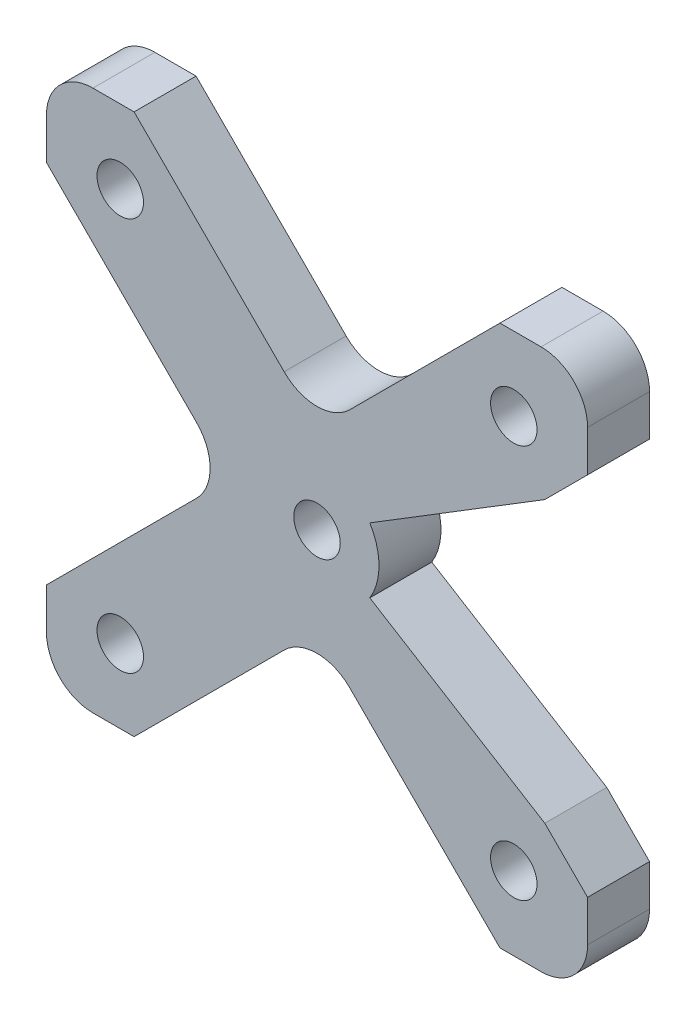
ISO-10303-21;
HEADER;
FILE_DESCRIPTION(('STEP AP214'),'2;1');
FILE_NAME('part.step','',(''),(''),'','','');
FILE_SCHEMA(('AUTOMOTIVE_DESIGN { 1 0 10303 214 1 1 1 1 }'));
ENDSEC;
DATA;
#1=APPLICATION_CONTEXT('core data for automotive mechanical design processes');
#2=APPLICATION_PROTOCOL_DEFINITION('international standard','automotive_design',2000,#1);
#3=PRODUCT_CONTEXT('',#1,'mechanical');
#4=PRODUCT('Part','Part','',(#3));
#5=PRODUCT_RELATED_PRODUCT_CATEGORY('part','',(#4));
#6=PRODUCT_DEFINITION_FORMATION('','',#4);
#7=PRODUCT_DEFINITION_CONTEXT('part definition',#1,'design');
#8=PRODUCT_DEFINITION('design','',#6,#7);
#9=PRODUCT_DEFINITION_SHAPE('','',#8);
#10=(LENGTH_UNIT() NAMED_UNIT(*) SI_UNIT(.MILLI.,.METRE.));
#11=(NAMED_UNIT(*) PLANE_ANGLE_UNIT() SI_UNIT($,.RADIAN.));
#12=(NAMED_UNIT(*) SI_UNIT($,.STERADIAN.) SOLID_ANGLE_UNIT());
#13=UNCERTAINTY_MEASURE_WITH_UNIT(LENGTH_MEASURE(1.E-05),#10,'distance_accuracy_value','');
#14=(GEOMETRIC_REPRESENTATION_CONTEXT(3) GLOBAL_UNCERTAINTY_ASSIGNED_CONTEXT((#13)) GLOBAL_UNIT_ASSIGNED_CONTEXT((#10,
#11,#12)) REPRESENTATION_CONTEXT('',''));
#15=CARTESIAN_POINT('',(0.,0.,0.));
#16=DIRECTION('',(0.,0.,1.));
#17=DIRECTION('',(1.,0.,0.));
#18=AXIS2_PLACEMENT_3D('',#15,#16,#17);
#19=CARTESIAN_POINT('',(0.,0.,4.));
#20=DIRECTION('',(0.,0.,1.));
#21=DIRECTION('',(1.,0.,0.));
#22=AXIS2_PLACEMENT_3D('',#19,#20,#21);
#23=PLANE('',#22);
#24=CARTESIAN_POINT('',(-12.7,-12.7,4.));
#25=DIRECTION('',(0.,0.,1.));
#26=DIRECTION('',(1.,0.,0.));
#27=AXIS2_PLACEMENT_3D('',#24,#25,#26);
#28=CIRCLE('',#27,1.5);
#29=CARTESIAN_POINT('',(-11.2,-12.7,4.));
#30=VERTEX_POINT('',#29);
#31=EDGE_CURVE('E363',#30,#30,#28,.T.);
#32=ORIENTED_EDGE('',*,*,#31,.F.);
#33=EDGE_LOOP('',(#32));
#34=FACE_BOUND('',#33,.T.);
#35=CARTESIAN_POINT('',(-12.7,12.7,4.));
#36=DIRECTION('',(0.,0.,1.));
#37=DIRECTION('',(1.,0.,0.));
#38=AXIS2_PLACEMENT_3D('',#35,#36,#37);
#39=CIRCLE('',#38,1.5);
#40=CARTESIAN_POINT('',(-11.2,12.7,4.));
#41=VERTEX_POINT('',#40);
#42=EDGE_CURVE('E366',#41,#41,#39,.T.);
#43=ORIENTED_EDGE('',*,*,#42,.F.);
#44=EDGE_LOOP('',(#43));
#45=FACE_BOUND('',#44,.T.);
#46=CARTESIAN_POINT('',(12.7,-12.7,4.));
#47=DIRECTION('',(0.,0.,1.));
#48=DIRECTION('',(1.,0.,0.));
#49=AXIS2_PLACEMENT_3D('',#46,#47,#48);
#50=CIRCLE('',#49,1.5);
#51=CARTESIAN_POINT('',(14.2,-12.7,4.));
#52=VERTEX_POINT('',#51);
#53=EDGE_CURVE('E370',#52,#52,#50,.T.);
#54=ORIENTED_EDGE('',*,*,#53,.F.);
#55=EDGE_LOOP('',(#54));
#56=FACE_BOUND('',#55,.T.);
#57=CARTESIAN_POINT('',(12.7,12.7,4.));
#58=DIRECTION('',(0.,0.,1.));
#59=DIRECTION('',(1.,0.,0.));
#60=AXIS2_PLACEMENT_3D('',#57,#58,#59);
#61=CIRCLE('',#60,1.5);
#62=CARTESIAN_POINT('',(14.2,12.7,4.));
#63=VERTEX_POINT('',#62);
#64=EDGE_CURVE('E373',#63,#63,#61,.T.);
#65=ORIENTED_EDGE('',*,*,#64,.F.);
#66=EDGE_LOOP('',(#65));
#67=FACE_BOUND('',#66,.T.);
#68=CARTESIAN_POINT('',(0.,0.,4.));
#69=DIRECTION('',(0.,0.,1.));
#70=DIRECTION('',(1.,0.,0.));
#71=AXIS2_PLACEMENT_3D('',#68,#69,#70);
#72=CIRCLE('',#71,1.5);
#73=CARTESIAN_POINT('',(1.49999999999999,0.,4.));
#74=VERTEX_POINT('',#73);
#75=EDGE_CURVE('E389',#74,#74,#72,.T.);
#76=ORIENTED_EDGE('',*,*,#75,.F.);
#77=EDGE_LOOP('',(#76));
#78=FACE_BOUND('',#77,.T.);
#79=DIRECTION('',(0.707106781186548,-0.707106781186548,0.));
#80=VECTOR('',#79,1.);
#81=CARTESIAN_POINT('',(2.82842712474619,2.82842712474619,4.));
#82=LINE('',#81,#80);
#83=CARTESIAN_POINT('',(14.7,-9.04314575050763,4.));
#84=VERTEX_POINT('',#83);
#85=CARTESIAN_POINT('',(17.4625,-11.8056457505076,4.));
#86=VERTEX_POINT('',#85);
#87=EDGE_CURVE('E332',#84,#86,#82,.T.);
#88=ORIENTED_EDGE('',*,*,#87,.F.);
#89=DIRECTION('',(-0.85173610323474,0.523971001532052,0.));
#90=VECTOR('',#89,1.);
#91=CARTESIAN_POINT('',(0.,0.,4.));
#92=LINE('',#91,#90);
#93=CARTESIAN_POINT('',(3.40694441293896,-2.09588400612821,4.));
#94=VERTEX_POINT('',#93);
#95=EDGE_CURVE('E123',#84,#94,#92,.T.);
#96=ORIENTED_EDGE('',*,*,#95,.T.);
#97=CARTESIAN_POINT('',(0.,0.,4.));
#98=DIRECTION('',(0.,0.,1.));
#99=DIRECTION('',(1.,0.,0.));
#100=AXIS2_PLACEMENT_3D('',#97,#98,#99);
#101=CIRCLE('',#100,4.);
#102=CARTESIAN_POINT('',(3.40694441293896,2.09588400612821,4.));
#103=VERTEX_POINT('',#102);
#104=EDGE_CURVE('E316',#94,#103,#101,.T.);
#105=ORIENTED_EDGE('',*,*,#104,.T.);
#106=DIRECTION('',(0.851736103234739,0.523971001532052,0.));
#107=VECTOR('',#106,1.);
#108=CARTESIAN_POINT('',(0.,0.,4.));
#109=LINE('',#108,#107);
#110=CARTESIAN_POINT('',(14.7,9.04314575050764,4.));
#111=VERTEX_POINT('',#110);
#112=EDGE_CURVE('E289',#103,#111,#109,.T.);
#113=ORIENTED_EDGE('',*,*,#112,.T.);
#114=DIRECTION('',(0.707106781186548,0.707106781186548,0.));
#115=VECTOR('',#114,1.);
#116=CARTESIAN_POINT('',(2.82842712474618,-2.82842712474618,4.));
#117=LINE('',#116,#115);
#118=CARTESIAN_POINT('',(17.4625,11.8056457505076,4.));
#119=VERTEX_POINT('',#118);
#120=EDGE_CURVE('E328',#111,#119,#117,.T.);
#121=ORIENTED_EDGE('',*,*,#120,.T.);
#122=DIRECTION('',(0.,1.,0.));
#123=VECTOR('',#122,1.);
#124=CARTESIAN_POINT('',(17.4625,0.,4.));
#125=LINE('',#124,#123);
#126=CARTESIAN_POINT('',(17.4625,14.4625,4.));
#127=VERTEX_POINT('',#126);
#128=EDGE_CURVE('E382',#119,#127,#125,.T.);
#129=ORIENTED_EDGE('',*,*,#128,.T.);
#130=CARTESIAN_POINT('',(14.4625,14.4625,4.));
#131=DIRECTION('',(0.,0.,1.));
#132=DIRECTION('',(1.,0.,0.));
#133=AXIS2_PLACEMENT_3D('',#130,#131,#132);
#134=CIRCLE('',#133,3.);
#135=CARTESIAN_POINT('',(14.4625,17.4625,4.));
#136=VERTEX_POINT('',#135);
#137=EDGE_CURVE('E464',#127,#136,#134,.T.);
#138=ORIENTED_EDGE('',*,*,#137,.T.);
#139=DIRECTION('',(-1.,0.,0.));
#140=VECTOR('',#139,1.);
#141=CARTESIAN_POINT('',(0.,17.4625,4.));
#142=LINE('',#141,#140);
#143=CARTESIAN_POINT('',(11.8056457505076,17.4625,4.));
#144=VERTEX_POINT('',#143);
#145=EDGE_CURVE('E386',#136,#144,#142,.T.);
#146=ORIENTED_EDGE('',*,*,#145,.T.);
#147=DIRECTION('',(0.707106781186548,0.707106781186548,0.));
#148=VECTOR('',#147,1.);
#149=CARTESIAN_POINT('',(-2.82842712474619,2.82842712474619,4.));
#150=LINE('',#149,#148);
#151=CARTESIAN_POINT('',(2.12132034355964,7.77817459305203,4.));
#152=VERTEX_POINT('',#151);
#153=EDGE_CURVE('E343',#152,#144,#150,.T.);
#154=ORIENTED_EDGE('',*,*,#153,.F.);
#155=CARTESIAN_POINT('',(0.,9.89949493661167,4.));
#156=DIRECTION('',(0.,0.,1.));
#157=DIRECTION('',(1.,0.,0.));
#158=AXIS2_PLACEMENT_3D('',#155,#156,#157);
#159=CIRCLE('',#158,3.);
#160=CARTESIAN_POINT('',(-2.12132034355965,7.77817459305203,4.));
#161=VERTEX_POINT('',#160);
#162=EDGE_CURVE('E116',#152,#161,#159,.F.);
#163=ORIENTED_EDGE('',*,*,#162,.T.);
#164=DIRECTION('',(0.707106781186548,-0.707106781186548,0.));
#165=VECTOR('',#164,1.);
#166=CARTESIAN_POINT('',(2.82842712474619,2.82842712474619,4.));
#167=LINE('',#166,#165);
#168=CARTESIAN_POINT('',(-11.8056457505076,17.4625,4.));
#169=VERTEX_POINT('',#168);
#170=EDGE_CURVE('E338',#169,#161,#167,.T.);
#171=ORIENTED_EDGE('',*,*,#170,.F.);
#172=CARTESIAN_POINT('',(-14.4625,17.4625,4.));
#173=VERTEX_POINT('',#172);
#174=EDGE_CURVE('E385',#169,#173,#142,.T.);
#175=ORIENTED_EDGE('',*,*,#174,.T.);
#176=CARTESIAN_POINT('',(-14.4625,14.4625,4.));
#177=DIRECTION('',(0.,0.,1.));
#178=DIRECTION('',(1.,0.,0.));
#179=AXIS2_PLACEMENT_3D('',#176,#177,#178);
#180=CIRCLE('',#179,3.);
#181=CARTESIAN_POINT('',(-17.4625,14.4625,4.));
#182=VERTEX_POINT('',#181);
#183=EDGE_CURVE('E462',#173,#182,#180,.T.);
#184=ORIENTED_EDGE('',*,*,#183,.T.);
#185=DIRECTION('',(0.,1.,0.));
#186=VECTOR('',#185,1.);
#187=CARTESIAN_POINT('',(-17.4625,0.,4.));
#188=LINE('',#187,#186);
#189=CARTESIAN_POINT('',(-17.4625,11.8056457505076,4.));
#190=VERTEX_POINT('',#189);
#191=EDGE_CURVE('E376',#190,#182,#188,.T.);
#192=ORIENTED_EDGE('',*,*,#191,.F.);
#193=DIRECTION('',(0.707106781186548,-0.707106781186548,0.));
#194=VECTOR('',#193,1.);
#195=CARTESIAN_POINT('',(-2.82842712474619,-2.82842712474619,4.));
#196=LINE('',#195,#194);
#197=CARTESIAN_POINT('',(-7.77817459305203,2.12132034355965,4.));
#198=VERTEX_POINT('',#197);
#199=EDGE_CURVE('E353',#190,#198,#196,.T.);
#200=ORIENTED_EDGE('',*,*,#199,.T.);
#201=CARTESIAN_POINT('',(-9.89949493661167,0.,4.));
#202=DIRECTION('',(0.,0.,1.));
#203=DIRECTION('',(1.,0.,0.));
#204=AXIS2_PLACEMENT_3D('',#201,#202,#203);
#205=CIRCLE('',#204,3.);
#206=CARTESIAN_POINT('',(-7.77817459305203,-2.12132034355964,4.));
#207=VERTEX_POINT('',#206);
#208=EDGE_CURVE('E489',#198,#207,#205,.F.);
#209=ORIENTED_EDGE('',*,*,#208,.T.);
#210=DIRECTION('',(0.707106781186548,0.707106781186548,0.));
#211=VECTOR('',#210,1.);
#212=CARTESIAN_POINT('',(-2.82842712474619,2.82842712474619,4.));
#213=LINE('',#212,#211);
#214=CARTESIAN_POINT('',(-17.4625,-11.8056457505076,4.));
#215=VERTEX_POINT('',#214);
#216=EDGE_CURVE('E348',#215,#207,#213,.T.);
#217=ORIENTED_EDGE('',*,*,#216,.F.);
#218=CARTESIAN_POINT('',(-17.4625,-14.4625,4.));
#219=VERTEX_POINT('',#218);
#220=EDGE_CURVE('E377',#219,#215,#188,.T.);
#221=ORIENTED_EDGE('',*,*,#220,.F.);
#222=CARTESIAN_POINT('',(-14.4625,-14.4625,4.));
#223=DIRECTION('',(0.,0.,1.));
#224=DIRECTION('',(1.,0.,0.));
#225=AXIS2_PLACEMENT_3D('',#222,#223,#224);
#226=CIRCLE('',#225,3.);
#227=CARTESIAN_POINT('',(-14.4625,-17.4625,4.));
#228=VERTEX_POINT('',#227);
#229=EDGE_CURVE('E467',#219,#228,#226,.T.);
#230=ORIENTED_EDGE('',*,*,#229,.T.);
#231=DIRECTION('',(-1.,0.,0.));
#232=VECTOR('',#231,1.);
#233=CARTESIAN_POINT('',(0.,-17.4625,4.));
#234=LINE('',#233,#232);
#235=CARTESIAN_POINT('',(-11.8056457505076,-17.4625,4.));
#236=VERTEX_POINT('',#235);
#237=EDGE_CURVE('E379',#236,#228,#234,.T.);
#238=ORIENTED_EDGE('',*,*,#237,.F.);
#239=DIRECTION('',(0.707106781186548,0.707106781186548,0.));
#240=VECTOR('',#239,1.);
#241=CARTESIAN_POINT('',(2.82842712474618,-2.82842712474618,4.));
#242=LINE('',#241,#240);
#243=CARTESIAN_POINT('',(-2.12132034355965,-7.77817459305202,4.));
#244=VERTEX_POINT('',#243);
#245=EDGE_CURVE('E318',#236,#244,#242,.T.);
#246=ORIENTED_EDGE('',*,*,#245,.T.);
#247=CARTESIAN_POINT('',(0.,-9.89949493661166,4.));
#248=DIRECTION('',(0.,0.,1.));
#249=DIRECTION('',(1.,0.,0.));
#250=AXIS2_PLACEMENT_3D('',#247,#248,#249);
#251=CIRCLE('',#250,3.);
#252=CARTESIAN_POINT('',(2.12132034355964,-7.77817459305202,4.));
#253=VERTEX_POINT('',#252);
#254=EDGE_CURVE('E493',#244,#253,#251,.F.);
#255=ORIENTED_EDGE('',*,*,#254,.T.);
#256=DIRECTION('',(0.707106781186548,-0.707106781186548,0.));
#257=VECTOR('',#256,1.);
#258=CARTESIAN_POINT('',(-2.82842712474619,-2.82842712474619,4.));
#259=LINE('',#258,#257);
#260=CARTESIAN_POINT('',(11.8056457505076,-17.4625,4.));
#261=VERTEX_POINT('',#260);
#262=EDGE_CURVE('E321',#253,#261,#259,.T.);
#263=ORIENTED_EDGE('',*,*,#262,.T.);
#264=CARTESIAN_POINT('',(14.4625,-17.4625,4.));
#265=VERTEX_POINT('',#264);
#266=EDGE_CURVE('E380',#265,#261,#234,.T.);
#267=ORIENTED_EDGE('',*,*,#266,.F.);
#268=CARTESIAN_POINT('',(14.4625,-14.4625,4.));
#269=DIRECTION('',(0.,0.,1.));
#270=DIRECTION('',(1.,0.,0.));
#271=AXIS2_PLACEMENT_3D('',#268,#269,#270);
#272=CIRCLE('',#271,3.);
#273=CARTESIAN_POINT('',(17.4625,-14.4625,4.));
#274=VERTEX_POINT('',#273);
#275=EDGE_CURVE('E131',#265,#274,#272,.T.);
#276=ORIENTED_EDGE('',*,*,#275,.T.);
#277=EDGE_CURVE('E383',#274,#86,#125,.T.);
#278=ORIENTED_EDGE('',*,*,#277,.T.);
#279=EDGE_LOOP('',(#88,#96,#105,#113,#121,#129,#138,#146,#154,#163,#171,#175,#184,#192,#200,
#209,#217,#221,#230,#238,#246,#255,#263,#267,#276,#278));
#280=FACE_BOUND('',#279,.T.);
#281=ADVANCED_FACE('F108',(#34,#45,#56,#67,#78,#280),#23,.T.);
#282=CARTESIAN_POINT('',(0.,0.,0.));
#283=DIRECTION('',(0.,0.,1.));
#284=DIRECTION('',(1.,0.,0.));
#285=AXIS2_PLACEMENT_3D('',#282,#283,#284);
#286=PLANE('',#285);
#287=CARTESIAN_POINT('',(-12.7,-12.7,0.));
#288=DIRECTION('',(0.,0.,1.));
#289=DIRECTION('',(1.,0.,0.));
#290=AXIS2_PLACEMENT_3D('',#287,#288,#289);
#291=CIRCLE('',#290,1.5);
#292=CARTESIAN_POINT('',(-11.2,-12.7,0.));
#293=VERTEX_POINT('',#292);
#294=EDGE_CURVE('E360',#293,#293,#291,.T.);
#295=ORIENTED_EDGE('',*,*,#294,.T.);
#296=EDGE_LOOP('',(#295));
#297=FACE_BOUND('',#296,.T.);
#298=CARTESIAN_POINT('',(-12.7,12.7,0.));
#299=DIRECTION('',(0.,0.,1.));
#300=DIRECTION('',(1.,0.,0.));
#301=AXIS2_PLACEMENT_3D('',#298,#299,#300);
#302=CIRCLE('',#301,1.5);
#303=CARTESIAN_POINT('',(-11.2,12.7,0.));
#304=VERTEX_POINT('',#303);
#305=EDGE_CURVE('E395',#304,#304,#302,.T.);
#306=ORIENTED_EDGE('',*,*,#305,.T.);
#307=EDGE_LOOP('',(#306));
#308=FACE_BOUND('',#307,.T.);
#309=CARTESIAN_POINT('',(12.7,-12.7,0.));
#310=DIRECTION('',(0.,0.,1.));
#311=DIRECTION('',(1.,0.,0.));
#312=AXIS2_PLACEMENT_3D('',#309,#310,#311);
#313=CIRCLE('',#312,1.5);
#314=CARTESIAN_POINT('',(14.2,-12.7,0.));
#315=VERTEX_POINT('',#314);
#316=EDGE_CURVE('E398',#315,#315,#313,.T.);
#317=ORIENTED_EDGE('',*,*,#316,.T.);
#318=EDGE_LOOP('',(#317));
#319=FACE_BOUND('',#318,.T.);
#320=CARTESIAN_POINT('',(12.7,12.7,0.));
#321=DIRECTION('',(0.,0.,1.));
#322=DIRECTION('',(1.,0.,0.));
#323=AXIS2_PLACEMENT_3D('',#320,#321,#322);
#324=CIRCLE('',#323,1.5);
#325=CARTESIAN_POINT('',(14.2,12.7,0.));
#326=VERTEX_POINT('',#325);
#327=EDGE_CURVE('E401',#326,#326,#324,.T.);
#328=ORIENTED_EDGE('',*,*,#327,.T.);
#329=EDGE_LOOP('',(#328));
#330=FACE_BOUND('',#329,.T.);
#331=CARTESIAN_POINT('',(0.,0.,0.));
#332=DIRECTION('',(0.,0.,1.));
#333=DIRECTION('',(1.,0.,0.));
#334=AXIS2_PLACEMENT_3D('',#331,#332,#333);
#335=CIRCLE('',#334,1.5);
#336=CARTESIAN_POINT('',(1.49999999999999,0.,0.));
#337=VERTEX_POINT('',#336);
#338=EDGE_CURVE('E367',#337,#337,#335,.T.);
#339=ORIENTED_EDGE('',*,*,#338,.T.);
#340=EDGE_LOOP('',(#339));
#341=FACE_BOUND('',#340,.T.);
#342=DIRECTION('',(0.85173610323474,-0.523971001532052,0.));
#343=VECTOR('',#342,1.);
#344=CARTESIAN_POINT('',(0.,0.,0.));
#345=LINE('',#344,#343);
#346=CARTESIAN_POINT('',(3.40694441293896,-2.09588400612821,0.));
#347=VERTEX_POINT('',#346);
#348=CARTESIAN_POINT('',(14.7,-9.04314575050762,0.));
#349=VERTEX_POINT('',#348);
#350=EDGE_CURVE('E293',#347,#349,#345,.T.);
#351=ORIENTED_EDGE('',*,*,#350,.T.);
#352=DIRECTION('',(0.707106781186548,-0.707106781186548,0.));
#353=VECTOR('',#352,1.);
#354=CARTESIAN_POINT('',(2.82842712474619,2.82842712474619,0.));
#355=LINE('',#354,#353);
#356=CARTESIAN_POINT('',(17.4625,-11.8056457505076,0.));
#357=VERTEX_POINT('',#356);
#358=EDGE_CURVE('E436',#349,#357,#355,.T.);
#359=ORIENTED_EDGE('',*,*,#358,.T.);
#360=DIRECTION('',(0.,1.,0.));
#361=VECTOR('',#360,1.);
#362=CARTESIAN_POINT('',(17.4625,0.,0.));
#363=LINE('',#362,#361);
#364=CARTESIAN_POINT('',(17.4625,-14.4625,0.));
#365=VERTEX_POINT('',#364);
#366=EDGE_CURVE('E411',#365,#357,#363,.T.);
#367=ORIENTED_EDGE('',*,*,#366,.F.);
#368=CARTESIAN_POINT('',(14.4625,-14.4625,0.));
#369=DIRECTION('',(0.,0.,1.));
#370=DIRECTION('',(1.,0.,0.));
#371=AXIS2_PLACEMENT_3D('',#368,#369,#370);
#372=CIRCLE('',#371,3.);
#373=CARTESIAN_POINT('',(14.4625,-17.4625,0.));
#374=VERTEX_POINT('',#373);
#375=EDGE_CURVE('E456',#365,#374,#372,.F.);
#376=ORIENTED_EDGE('',*,*,#375,.T.);
#377=DIRECTION('',(-1.,0.,0.));
#378=VECTOR('',#377,1.);
#379=CARTESIAN_POINT('',(0.,-17.4625,0.));
#380=LINE('',#379,#378);
#381=CARTESIAN_POINT('',(11.8056457505076,-17.4625,0.));
#382=VERTEX_POINT('',#381);
#383=EDGE_CURVE('E408',#374,#382,#380,.T.);
#384=ORIENTED_EDGE('',*,*,#383,.T.);
#385=DIRECTION('',(0.707106781186548,-0.707106781186548,0.));
#386=VECTOR('',#385,1.);
#387=CARTESIAN_POINT('',(-2.82842712474619,-2.82842712474619,0.));
#388=LINE('',#387,#386);
#389=CARTESIAN_POINT('',(2.12132034355964,-7.77817459305202,0.));
#390=VERTEX_POINT('',#389);
#391=EDGE_CURVE('E424',#390,#382,#388,.T.);
#392=ORIENTED_EDGE('',*,*,#391,.F.);
#393=CARTESIAN_POINT('',(0.,-9.89949493661166,0.));
#394=DIRECTION('',(0.,0.,1.));
#395=DIRECTION('',(1.,0.,0.));
#396=AXIS2_PLACEMENT_3D('',#393,#394,#395);
#397=CIRCLE('',#396,3.);
#398=CARTESIAN_POINT('',(-2.12132034355965,-7.77817459305202,0.));
#399=VERTEX_POINT('',#398);
#400=EDGE_CURVE('E495',#390,#399,#397,.T.);
#401=ORIENTED_EDGE('',*,*,#400,.T.);
#402=DIRECTION('',(0.707106781186548,0.707106781186548,0.));
#403=VECTOR('',#402,1.);
#404=CARTESIAN_POINT('',(2.82842712474618,-2.82842712474618,0.));
#405=LINE('',#404,#403);
#406=CARTESIAN_POINT('',(-11.8056457505076,-17.4625,0.));
#407=VERTEX_POINT('',#406);
#408=EDGE_CURVE('E427',#407,#399,#405,.T.);
#409=ORIENTED_EDGE('',*,*,#408,.F.);
#410=CARTESIAN_POINT('',(-14.4625,-17.4625,0.));
#411=VERTEX_POINT('',#410);
#412=EDGE_CURVE('E407',#407,#411,#380,.T.);
#413=ORIENTED_EDGE('',*,*,#412,.T.);
#414=CARTESIAN_POINT('',(-14.4625,-14.4625,0.));
#415=DIRECTION('',(0.,0.,1.));
#416=DIRECTION('',(1.,0.,0.));
#417=AXIS2_PLACEMENT_3D('',#414,#415,#416);
#418=CIRCLE('',#417,3.);
#419=CARTESIAN_POINT('',(-17.4625,-14.4625,0.));
#420=VERTEX_POINT('',#419);
#421=EDGE_CURVE('E458',#411,#420,#418,.F.);
#422=ORIENTED_EDGE('',*,*,#421,.T.);
#423=DIRECTION('',(0.,1.,0.));
#424=VECTOR('',#423,1.);
#425=CARTESIAN_POINT('',(-17.4625,0.,0.));
#426=LINE('',#425,#424);
#427=CARTESIAN_POINT('',(-17.4625,-11.8056457505076,0.));
#428=VERTEX_POINT('',#427);
#429=EDGE_CURVE('E405',#420,#428,#426,.T.);
#430=ORIENTED_EDGE('',*,*,#429,.T.);
#431=DIRECTION('',(0.707106781186548,0.707106781186548,0.));
#432=VECTOR('',#431,1.);
#433=CARTESIAN_POINT('',(-2.82842712474619,2.82842712474619,0.));
#434=LINE('',#433,#432);
#435=CARTESIAN_POINT('',(-7.77817459305203,-2.12132034355964,0.));
#436=VERTEX_POINT('',#435);
#437=EDGE_CURVE('E392',#428,#436,#434,.T.);
#438=ORIENTED_EDGE('',*,*,#437,.T.);
#439=CARTESIAN_POINT('',(-9.89949493661167,0.,0.));
#440=DIRECTION('',(0.,0.,1.));
#441=DIRECTION('',(1.,0.,0.));
#442=AXIS2_PLACEMENT_3D('',#439,#440,#441);
#443=CIRCLE('',#442,3.);
#444=CARTESIAN_POINT('',(-7.77817459305203,2.12132034355965,0.));
#445=VERTEX_POINT('',#444);
#446=EDGE_CURVE('E491',#436,#445,#443,.T.);
#447=ORIENTED_EDGE('',*,*,#446,.T.);
#448=DIRECTION('',(0.707106781186548,-0.707106781186548,0.));
#449=VECTOR('',#448,1.);
#450=CARTESIAN_POINT('',(-2.82842712474619,-2.82842712474619,0.));
#451=LINE('',#450,#449);
#452=CARTESIAN_POINT('',(-17.4625,11.8056457505076,0.));
#453=VERTEX_POINT('',#452);
#454=EDGE_CURVE('E421',#453,#445,#451,.T.);
#455=ORIENTED_EDGE('',*,*,#454,.F.);
#456=CARTESIAN_POINT('',(-17.4625,14.4625,0.));
#457=VERTEX_POINT('',#456);
#458=EDGE_CURVE('E404',#453,#457,#426,.T.);
#459=ORIENTED_EDGE('',*,*,#458,.T.);
#460=CARTESIAN_POINT('',(-14.4625,14.4625,0.));
#461=DIRECTION('',(0.,0.,1.));
#462=DIRECTION('',(1.,0.,0.));
#463=AXIS2_PLACEMENT_3D('',#460,#461,#462);
#464=CIRCLE('',#463,3.);
#465=CARTESIAN_POINT('',(-14.4625,17.4625,0.));
#466=VERTEX_POINT('',#465);
#467=EDGE_CURVE('E452',#457,#466,#464,.F.);
#468=ORIENTED_EDGE('',*,*,#467,.T.);
#469=DIRECTION('',(-1.,0.,0.));
#470=VECTOR('',#469,1.);
#471=CARTESIAN_POINT('',(0.,17.4625,0.));
#472=LINE('',#471,#470);
#473=CARTESIAN_POINT('',(-11.8056457505076,17.4625,0.));
#474=VERTEX_POINT('',#473);
#475=EDGE_CURVE('E414',#474,#466,#472,.T.);
#476=ORIENTED_EDGE('',*,*,#475,.F.);
#477=DIRECTION('',(0.707106781186548,-0.707106781186548,0.));
#478=VECTOR('',#477,1.);
#479=CARTESIAN_POINT('',(2.82842712474619,2.82842712474619,0.));
#480=LINE('',#479,#478);
#481=CARTESIAN_POINT('',(-2.12132034355965,7.77817459305203,0.));
#482=VERTEX_POINT('',#481);
#483=EDGE_CURVE('E433',#474,#482,#480,.T.);
#484=ORIENTED_EDGE('',*,*,#483,.T.);
#485=CARTESIAN_POINT('',(0.,9.89949493661167,0.));
#486=DIRECTION('',(0.,0.,1.));
#487=DIRECTION('',(1.,0.,0.));
#488=AXIS2_PLACEMENT_3D('',#485,#486,#487);
#489=CIRCLE('',#488,3.);
#490=CARTESIAN_POINT('',(2.12132034355964,7.77817459305203,0.));
#491=VERTEX_POINT('',#490);
#492=EDGE_CURVE('E12',#482,#491,#489,.T.);
#493=ORIENTED_EDGE('',*,*,#492,.T.);
#494=DIRECTION('',(0.707106781186548,0.707106781186548,0.));
#495=VECTOR('',#494,1.);
#496=CARTESIAN_POINT('',(-2.82842712474619,2.82842712474619,0.));
#497=LINE('',#496,#495);
#498=CARTESIAN_POINT('',(11.8056457505076,17.4625,0.));
#499=VERTEX_POINT('',#498);
#500=EDGE_CURVE('E430',#491,#499,#497,.T.);
#501=ORIENTED_EDGE('',*,*,#500,.T.);
#502=CARTESIAN_POINT('',(14.4625,17.4625,0.));
#503=VERTEX_POINT('',#502);
#504=EDGE_CURVE('E415',#503,#499,#472,.T.);
#505=ORIENTED_EDGE('',*,*,#504,.F.);
#506=CARTESIAN_POINT('',(14.4625,14.4625,0.));
#507=DIRECTION('',(0.,0.,1.));
#508=DIRECTION('',(1.,0.,0.));
#509=AXIS2_PLACEMENT_3D('',#506,#507,#508);
#510=CIRCLE('',#509,3.);
#511=CARTESIAN_POINT('',(17.4625,14.4625,0.));
#512=VERTEX_POINT('',#511);
#513=EDGE_CURVE('E454',#503,#512,#510,.F.);
#514=ORIENTED_EDGE('',*,*,#513,.T.);
#515=CARTESIAN_POINT('',(17.4625,11.8056457505076,0.));
#516=VERTEX_POINT('',#515);
#517=EDGE_CURVE('E410',#516,#512,#363,.T.);
#518=ORIENTED_EDGE('',*,*,#517,.F.);
#519=DIRECTION('',(0.707106781186548,0.707106781186548,0.));
#520=VECTOR('',#519,1.);
#521=CARTESIAN_POINT('',(2.82842712474618,-2.82842712474618,0.));
#522=LINE('',#521,#520);
#523=CARTESIAN_POINT('',(14.7,9.04314575050764,0.));
#524=VERTEX_POINT('',#523);
#525=EDGE_CURVE('E306',#524,#516,#522,.T.);
#526=ORIENTED_EDGE('',*,*,#525,.F.);
#527=DIRECTION('',(-0.851736103234739,-0.523971001532052,0.));
#528=VECTOR('',#527,1.);
#529=CARTESIAN_POINT('',(0.,0.,0.));
#530=LINE('',#529,#528);
#531=CARTESIAN_POINT('',(3.40694441293896,2.09588400612821,0.));
#532=VERTEX_POINT('',#531);
#533=EDGE_CURVE('E286',#524,#532,#530,.T.);
#534=ORIENTED_EDGE('',*,*,#533,.T.);
#535=CARTESIAN_POINT('',(0.,0.,0.));
#536=DIRECTION('',(0.,0.,-1.));
#537=DIRECTION('',(-1.,0.,0.));
#538=AXIS2_PLACEMENT_3D('',#535,#536,#537);
#539=CIRCLE('',#538,4.);
#540=EDGE_CURVE('E296',#532,#347,#539,.T.);
#541=ORIENTED_EDGE('',*,*,#540,.T.);
#542=EDGE_LOOP('',(#351,#359,#367,#376,#384,#392,#401,#409,#413,#422,#430,#438,#447,#455,#459,
#468,#476,#484,#493,#501,#505,#514,#518,#526,#534,#541));
#543=FACE_BOUND('',#542,.T.);
#544=ADVANCED_FACE('F304',(#297,#308,#319,#330,#341,#543),#286,.F.);
#545=CARTESIAN_POINT('',(2.82842712474618,-2.82842712474618,-1.08));
#546=DIRECTION('',(0.707106781186548,-0.707106781186548,0.));
#547=DIRECTION('',(0.707106781186548,0.707106781186548,0.));
#548=AXIS2_PLACEMENT_3D('',#545,#546,#547);
#549=PLANE('',#548);
#550=ORIENTED_EDGE('',*,*,#120,.F.);
#551=DIRECTION('',(0.,0.,-1.));
#552=VECTOR('',#551,1.);
#553=CARTESIAN_POINT('',(14.7,9.04314575050764,5.08));
#554=LINE('',#553,#552);
#555=EDGE_CURVE('E292',#111,#524,#554,.T.);
#556=ORIENTED_EDGE('',*,*,#555,.T.);
#557=ORIENTED_EDGE('',*,*,#525,.T.);
#558=DIRECTION('',(0.,0.,1.));
#559=VECTOR('',#558,1.);
#560=CARTESIAN_POINT('',(17.4625,11.8056457505076,-1.08));
#561=LINE('',#560,#559);
#562=EDGE_CURVE('E335',#516,#119,#561,.T.);
#563=ORIENTED_EDGE('',*,*,#562,.T.);
#564=EDGE_LOOP('',(#550,#556,#557,#563));
#565=FACE_BOUND('',#564,.T.);
#566=ADVANCED_FACE('F531',(#565),#549,.T.);
#567=CARTESIAN_POINT('',(2.82842712474619,2.82842712474619,-1.08));
#568=DIRECTION('',(-0.707106781186548,-0.707106781186548,0.));
#569=DIRECTION('',(0.707106781186548,-0.707106781186548,0.));
#570=AXIS2_PLACEMENT_3D('',#567,#568,#569);
#571=PLANE('',#570);
#572=DIRECTION('',(0.,0.,-1.));
#573=VECTOR('',#572,1.);
#574=CARTESIAN_POINT('',(14.7,-9.04314575050762,5.08));
#575=LINE('',#574,#573);
#576=EDGE_CURVE('E311',#84,#349,#575,.T.);
#577=ORIENTED_EDGE('',*,*,#576,.F.);
#578=ORIENTED_EDGE('',*,*,#87,.T.);
#579=DIRECTION('',(0.,0.,1.));
#580=VECTOR('',#579,1.);
#581=CARTESIAN_POINT('',(17.4625,-11.8056457505076,-1.08));
#582=LINE('',#581,#580);
#583=EDGE_CURVE('E334',#357,#86,#582,.T.);
#584=ORIENTED_EDGE('',*,*,#583,.F.);
#585=ORIENTED_EDGE('',*,*,#358,.F.);
#586=EDGE_LOOP('',(#577,#578,#584,#585));
#587=FACE_BOUND('',#586,.T.);
#588=ADVANCED_FACE('F533',(#587),#571,.F.);
#589=CARTESIAN_POINT('',(-17.4625,0.,4.));
#590=DIRECTION('',(-1.,0.,0.));
#591=DIRECTION('',(0.,0.,1.));
#592=AXIS2_PLACEMENT_3D('',#589,#590,#591);
#593=PLANE('',#592);
#594=ORIENTED_EDGE('',*,*,#191,.T.);
#595=DIRECTION('',(0.,0.,-1.));
#596=VECTOR('',#595,1.);
#597=CARTESIAN_POINT('',(-17.4625,14.4625,0.));
#598=LINE('',#597,#596);
#599=EDGE_CURVE('E484',#182,#457,#598,.T.);
#600=ORIENTED_EDGE('',*,*,#599,.T.);
#601=ORIENTED_EDGE('',*,*,#458,.F.);
#602=DIRECTION('',(0.,0.,1.));
#603=VECTOR('',#602,1.);
#604=CARTESIAN_POINT('',(-17.4625,11.8056457505076,-1.08));
#605=LINE('',#604,#603);
#606=EDGE_CURVE('E357',#453,#190,#605,.T.);
#607=ORIENTED_EDGE('',*,*,#606,.T.);
#608=EDGE_LOOP('',(#594,#600,#601,#607));
#609=FACE_BOUND('',#608,.T.);
#610=ADVANCED_FACE('F539',(#609),#593,.T.);
#611=CARTESIAN_POINT('',(0.,-17.4625,4.));
#612=DIRECTION('',(0.,-1.,0.));
#613=DIRECTION('',(1.,0.,0.));
#614=AXIS2_PLACEMENT_3D('',#611,#612,#613);
#615=PLANE('',#614);
#616=ORIENTED_EDGE('',*,*,#237,.T.);
#617=DIRECTION('',(0.,0.,-1.));
#618=VECTOR('',#617,1.);
#619=CARTESIAN_POINT('',(-14.4625,-17.4625,4.));
#620=LINE('',#619,#618);
#621=EDGE_CURVE('E449',#228,#411,#620,.T.);
#622=ORIENTED_EDGE('',*,*,#621,.T.);
#623=ORIENTED_EDGE('',*,*,#412,.F.);
#624=DIRECTION('',(0.,0.,1.));
#625=VECTOR('',#624,1.);
#626=CARTESIAN_POINT('',(-11.8056457505076,-17.4625,-1.08));
#627=LINE('',#626,#625);
#628=EDGE_CURVE('E324',#407,#236,#627,.T.);
#629=ORIENTED_EDGE('',*,*,#628,.T.);
#630=EDGE_LOOP('',(#616,#622,#623,#629));
#631=FACE_BOUND('',#630,.T.);
#632=ADVANCED_FACE('F571',(#631),#615,.T.);
#633=ORIENTED_EDGE('',*,*,#383,.F.);
#634=DIRECTION('',(0.,0.,-1.));
#635=VECTOR('',#634,1.);
#636=CARTESIAN_POINT('',(14.4625,-17.4625,4.));
#637=LINE('',#636,#635);
#638=EDGE_CURVE('E472',#374,#265,#637,.F.);
#639=ORIENTED_EDGE('',*,*,#638,.T.);
#640=ORIENTED_EDGE('',*,*,#266,.T.);
#641=DIRECTION('',(0.,0.,1.));
#642=VECTOR('',#641,1.);
#643=CARTESIAN_POINT('',(11.8056457505076,-17.4625,-1.08));
#644=LINE('',#643,#642);
#645=EDGE_CURVE('E325',#382,#261,#644,.T.);
#646=ORIENTED_EDGE('',*,*,#645,.F.);
#647=EDGE_LOOP('',(#633,#639,#640,#646));
#648=FACE_BOUND('',#647,.T.);
#649=ADVANCED_FACE('F574',(#648),#615,.T.);
#650=CARTESIAN_POINT('',(17.4625,0.,4.));
#651=DIRECTION('',(-1.,0.,0.));
#652=DIRECTION('',(0.,0.,1.));
#653=AXIS2_PLACEMENT_3D('',#650,#651,#652);
#654=PLANE('',#653);
#655=ORIENTED_EDGE('',*,*,#517,.T.);
#656=DIRECTION('',(0.,0.,-1.));
#657=VECTOR('',#656,1.);
#658=CARTESIAN_POINT('',(17.4625,14.4625,4.));
#659=LINE('',#658,#657);
#660=EDGE_CURVE('E477',#512,#127,#659,.F.);
#661=ORIENTED_EDGE('',*,*,#660,.T.);
#662=ORIENTED_EDGE('',*,*,#128,.F.);
#663=ORIENTED_EDGE('',*,*,#562,.F.);
#664=EDGE_LOOP('',(#655,#661,#662,#663));
#665=FACE_BOUND('',#664,.T.);
#666=ADVANCED_FACE('F524',(#665),#654,.F.);
#667=CARTESIAN_POINT('',(0.,17.4625,4.));
#668=DIRECTION('',(0.,-1.,0.));
#669=DIRECTION('',(0.,0.,-1.));
#670=AXIS2_PLACEMENT_3D('',#667,#668,#669);
#671=PLANE('',#670);
#672=ORIENTED_EDGE('',*,*,#475,.T.);
#673=DIRECTION('',(0.,0.,-1.));
#674=VECTOR('',#673,1.);
#675=CARTESIAN_POINT('',(-14.4625,17.4625,4.));
#676=LINE('',#675,#674);
#677=EDGE_CURVE('E487',#466,#173,#676,.F.);
#678=ORIENTED_EDGE('',*,*,#677,.T.);
#679=ORIENTED_EDGE('',*,*,#174,.F.);
#680=DIRECTION('',(0.,0.,1.));
#681=VECTOR('',#680,1.);
#682=CARTESIAN_POINT('',(-11.8056457505076,17.4625,-1.08));
#683=LINE('',#682,#681);
#684=EDGE_CURVE('E346',#474,#169,#683,.T.);
#685=ORIENTED_EDGE('',*,*,#684,.F.);
#686=EDGE_LOOP('',(#672,#678,#679,#685));
#687=FACE_BOUND('',#686,.T.);
#688=ADVANCED_FACE('F566',(#687),#671,.F.);
#689=ORIENTED_EDGE('',*,*,#429,.F.);
#690=DIRECTION('',(0.,0.,-1.));
#691=VECTOR('',#690,1.);
#692=CARTESIAN_POINT('',(-17.4625,-14.4625,4.));
#693=LINE('',#692,#691);
#694=EDGE_CURVE('E460',#420,#219,#693,.F.);
#695=ORIENTED_EDGE('',*,*,#694,.T.);
#696=ORIENTED_EDGE('',*,*,#220,.T.);
#697=DIRECTION('',(0.,0.,1.));
#698=VECTOR('',#697,1.);
#699=CARTESIAN_POINT('',(-17.4625,-11.8056457505076,-1.08));
#700=LINE('',#699,#698);
#701=EDGE_CURVE('E356',#428,#215,#700,.T.);
#702=ORIENTED_EDGE('',*,*,#701,.F.);
#703=EDGE_LOOP('',(#689,#695,#696,#702));
#704=FACE_BOUND('',#703,.T.);
#705=ADVANCED_FACE('F569',(#704),#593,.T.);
#706=ORIENTED_EDGE('',*,*,#277,.F.);
#707=DIRECTION('',(0.,0.,-1.));
#708=VECTOR('',#707,1.);
#709=CARTESIAN_POINT('',(17.4625,-14.4625,0.));
#710=LINE('',#709,#708);
#711=EDGE_CURVE('E469',#274,#365,#710,.T.);
#712=ORIENTED_EDGE('',*,*,#711,.T.);
#713=ORIENTED_EDGE('',*,*,#366,.T.);
#714=ORIENTED_EDGE('',*,*,#583,.T.);
#715=EDGE_LOOP('',(#706,#712,#713,#714));
#716=FACE_BOUND('',#715,.T.);
#717=ADVANCED_FACE('F565',(#716),#654,.F.);
#718=ORIENTED_EDGE('',*,*,#145,.F.);
#719=DIRECTION('',(0.,0.,-1.));
#720=VECTOR('',#719,1.);
#721=CARTESIAN_POINT('',(14.4625,17.4625,4.));
#722=LINE('',#721,#720);
#723=EDGE_CURVE('E474',#136,#503,#722,.T.);
#724=ORIENTED_EDGE('',*,*,#723,.T.);
#725=ORIENTED_EDGE('',*,*,#504,.T.);
#726=DIRECTION('',(0.,0.,1.));
#727=VECTOR('',#726,1.);
#728=CARTESIAN_POINT('',(11.8056457505076,17.4625,-1.08));
#729=LINE('',#728,#727);
#730=EDGE_CURVE('E345',#499,#144,#729,.T.);
#731=ORIENTED_EDGE('',*,*,#730,.T.);
#732=EDGE_LOOP('',(#718,#724,#725,#731));
#733=FACE_BOUND('',#732,.T.);
#734=ADVANCED_FACE('F517',(#733),#671,.F.);
#735=CARTESIAN_POINT('',(12.7,12.7,4.));
#736=DIRECTION('',(0.,0.,-1.));
#737=DIRECTION('',(-1.,0.,0.));
#738=AXIS2_PLACEMENT_3D('',#735,#736,#737);
#739=CYLINDRICAL_SURFACE('',#738,1.5);
#740=ORIENTED_EDGE('',*,*,#64,.T.);
#741=EDGE_LOOP('',(#740));
#742=FACE_BOUND('',#741,.T.);
#743=ORIENTED_EDGE('',*,*,#327,.F.);
#744=EDGE_LOOP('',(#743));
#745=FACE_BOUND('',#744,.T.);
#746=ADVANCED_FACE('F564',(#742,#745),#739,.F.);
#747=CARTESIAN_POINT('',(12.7,-12.7,4.));
#748=DIRECTION('',(0.,0.,-1.));
#749=DIRECTION('',(-1.,0.,0.));
#750=AXIS2_PLACEMENT_3D('',#747,#748,#749);
#751=CYLINDRICAL_SURFACE('',#750,1.5);
#752=ORIENTED_EDGE('',*,*,#53,.T.);
#753=EDGE_LOOP('',(#752));
#754=FACE_BOUND('',#753,.T.);
#755=ORIENTED_EDGE('',*,*,#316,.F.);
#756=EDGE_LOOP('',(#755));
#757=FACE_BOUND('',#756,.T.);
#758=ADVANCED_FACE('F581',(#754,#757),#751,.F.);
#759=CARTESIAN_POINT('',(-12.7,12.7,4.));
#760=DIRECTION('',(0.,0.,-1.));
#761=DIRECTION('',(-1.,0.,0.));
#762=AXIS2_PLACEMENT_3D('',#759,#760,#761);
#763=CYLINDRICAL_SURFACE('',#762,1.5);
#764=ORIENTED_EDGE('',*,*,#42,.T.);
#765=EDGE_LOOP('',(#764));
#766=FACE_BOUND('',#765,.T.);
#767=ORIENTED_EDGE('',*,*,#305,.F.);
#768=EDGE_LOOP('',(#767));
#769=FACE_BOUND('',#768,.T.);
#770=ADVANCED_FACE('F585',(#766,#769),#763,.F.);
#771=CARTESIAN_POINT('',(-12.7,-12.7,4.));
#772=DIRECTION('',(0.,0.,-1.));
#773=DIRECTION('',(-1.,0.,0.));
#774=AXIS2_PLACEMENT_3D('',#771,#772,#773);
#775=CYLINDRICAL_SURFACE('',#774,1.5);
#776=ORIENTED_EDGE('',*,*,#31,.T.);
#777=EDGE_LOOP('',(#776));
#778=FACE_BOUND('',#777,.T.);
#779=ORIENTED_EDGE('',*,*,#294,.F.);
#780=EDGE_LOOP('',(#779));
#781=FACE_BOUND('',#780,.T.);
#782=ADVANCED_FACE('F560',(#778,#781),#775,.F.);
#783=CARTESIAN_POINT('',(0.,0.,4.));
#784=DIRECTION('',(0.,0.,-1.));
#785=DIRECTION('',(-1.,0.,0.));
#786=AXIS2_PLACEMENT_3D('',#783,#784,#785);
#787=CYLINDRICAL_SURFACE('',#786,1.5);
#788=ORIENTED_EDGE('',*,*,#75,.T.);
#789=EDGE_LOOP('',(#788));
#790=FACE_BOUND('',#789,.T.);
#791=ORIENTED_EDGE('',*,*,#338,.F.);
#792=EDGE_LOOP('',(#791));
#793=FACE_BOUND('',#792,.T.);
#794=ADVANCED_FACE('F556',(#790,#793),#787,.F.);
#795=CARTESIAN_POINT('',(-2.82842712474619,-2.82842712474619,-1.08));
#796=DIRECTION('',(-0.707106781186548,-0.707106781186548,0.));
#797=DIRECTION('',(0.707106781186548,-0.707106781186548,0.));
#798=AXIS2_PLACEMENT_3D('',#795,#796,#797);
#799=PLANE('',#798);
#800=ORIENTED_EDGE('',*,*,#454,.T.);
#801=DIRECTION('',(0.,0.,1.));
#802=VECTOR('',#801,1.);
#803=CARTESIAN_POINT('',(-7.77817459305203,2.12132034355965,-1.08));
#804=LINE('',#803,#802);
#805=EDGE_CURVE('E439',#445,#198,#804,.T.);
#806=ORIENTED_EDGE('',*,*,#805,.T.);
#807=ORIENTED_EDGE('',*,*,#199,.F.);
#808=ORIENTED_EDGE('',*,*,#606,.F.);
#809=EDGE_LOOP('',(#800,#806,#807,#808));
#810=FACE_BOUND('',#809,.T.);
#811=ADVANCED_FACE('F559',(#810),#799,.T.);
#812=CARTESIAN_POINT('',(-2.82842712474619,2.82842712474619,-1.08));
#813=DIRECTION('',(0.707106781186548,-0.707106781186548,0.));
#814=DIRECTION('',(0.707106781186548,0.707106781186548,0.));
#815=AXIS2_PLACEMENT_3D('',#812,#813,#814);
#816=PLANE('',#815);
#817=ORIENTED_EDGE('',*,*,#216,.T.);
#818=DIRECTION('',(0.,0.,1.));
#819=VECTOR('',#818,1.);
#820=CARTESIAN_POINT('',(-7.77817459305203,-2.12132034355964,-1.08));
#821=LINE('',#820,#819);
#822=EDGE_CURVE('E442',#207,#436,#821,.F.);
#823=ORIENTED_EDGE('',*,*,#822,.T.);
#824=ORIENTED_EDGE('',*,*,#437,.F.);
#825=ORIENTED_EDGE('',*,*,#701,.T.);
#826=EDGE_LOOP('',(#817,#823,#824,#825));
#827=FACE_BOUND('',#826,.T.);
#828=ADVANCED_FACE('F553',(#827),#816,.F.);
#829=CARTESIAN_POINT('',(2.82842712474618,-2.82842712474618,-1.08));
#830=DIRECTION('',(0.707106781186548,-0.707106781186548,0.));
#831=DIRECTION('',(0.707106781186548,0.707106781186548,0.));
#832=AXIS2_PLACEMENT_3D('',#829,#830,#831);
#833=PLANE('',#832);
#834=ORIENTED_EDGE('',*,*,#408,.T.);
#835=DIRECTION('',(0.,0.,1.));
#836=VECTOR('',#835,1.);
#837=CARTESIAN_POINT('',(-2.12132034355965,-7.77817459305202,4.));
#838=LINE('',#837,#836);
#839=EDGE_CURVE('E444',#399,#244,#838,.T.);
#840=ORIENTED_EDGE('',*,*,#839,.T.);
#841=ORIENTED_EDGE('',*,*,#245,.F.);
#842=ORIENTED_EDGE('',*,*,#628,.F.);
#843=EDGE_LOOP('',(#834,#840,#841,#842));
#844=FACE_BOUND('',#843,.T.);
#845=ADVANCED_FACE('F651',(#844),#833,.T.);
#846=CARTESIAN_POINT('',(-2.82842712474619,-2.82842712474619,-1.08));
#847=DIRECTION('',(-0.707106781186548,-0.707106781186548,0.));
#848=DIRECTION('',(0.707106781186548,-0.707106781186548,0.));
#849=AXIS2_PLACEMENT_3D('',#846,#847,#848);
#850=PLANE('',#849);
#851=ORIENTED_EDGE('',*,*,#262,.F.);
#852=DIRECTION('',(0.,0.,1.));
#853=VECTOR('',#852,1.);
#854=CARTESIAN_POINT('',(2.12132034355964,-7.77817459305202,0.));
#855=LINE('',#854,#853);
#856=EDGE_CURVE('E447',#253,#390,#855,.F.);
#857=ORIENTED_EDGE('',*,*,#856,.T.);
#858=ORIENTED_EDGE('',*,*,#391,.T.);
#859=ORIENTED_EDGE('',*,*,#645,.T.);
#860=EDGE_LOOP('',(#851,#857,#858,#859));
#861=FACE_BOUND('',#860,.T.);
#862=ADVANCED_FACE('F655',(#861),#850,.T.);
#863=CARTESIAN_POINT('',(2.82842712474619,2.82842712474619,-1.08));
#864=DIRECTION('',(-0.707106781186548,-0.707106781186548,0.));
#865=DIRECTION('',(0.707106781186548,-0.707106781186548,0.));
#866=AXIS2_PLACEMENT_3D('',#863,#864,#865);
#867=PLANE('',#866);
#868=ORIENTED_EDGE('',*,*,#170,.T.);
#869=DIRECTION('',(0.,0.,1.));
#870=VECTOR('',#869,1.);
#871=CARTESIAN_POINT('',(-2.12132034355965,7.77817459305203,0.));
#872=LINE('',#871,#870);
#873=EDGE_CURVE('E482',#161,#482,#872,.F.);
#874=ORIENTED_EDGE('',*,*,#873,.T.);
#875=ORIENTED_EDGE('',*,*,#483,.F.);
#876=ORIENTED_EDGE('',*,*,#684,.T.);
#877=EDGE_LOOP('',(#868,#874,#875,#876));
#878=FACE_BOUND('',#877,.T.);
#879=ADVANCED_FACE('F505',(#878),#867,.F.);
#880=CARTESIAN_POINT('',(-2.82842712474619,2.82842712474619,-1.08));
#881=DIRECTION('',(0.707106781186548,-0.707106781186548,0.));
#882=DIRECTION('',(0.707106781186548,0.707106781186548,0.));
#883=AXIS2_PLACEMENT_3D('',#880,#881,#882);
#884=PLANE('',#883);
#885=ORIENTED_EDGE('',*,*,#500,.F.);
#886=DIRECTION('',(0.,0.,1.));
#887=VECTOR('',#886,1.);
#888=CARTESIAN_POINT('',(2.12132034355964,7.77817459305202,4.));
#889=LINE('',#888,#887);
#890=EDGE_CURVE('E479',#491,#152,#889,.T.);
#891=ORIENTED_EDGE('',*,*,#890,.T.);
#892=ORIENTED_EDGE('',*,*,#153,.T.);
#893=ORIENTED_EDGE('',*,*,#730,.F.);
#894=EDGE_LOOP('',(#885,#891,#892,#893));
#895=FACE_BOUND('',#894,.T.);
#896=ADVANCED_FACE('F514',(#895),#884,.F.);
#897=CARTESIAN_POINT('',(-9.89949493661167,0.,-1.08));
#898=DIRECTION('',(0.,0.,1.));
#899=DIRECTION('',(1.,0.,0.));
#900=AXIS2_PLACEMENT_3D('',#897,#898,#899);
#901=CYLINDRICAL_SURFACE('',#900,3.);
#902=ORIENTED_EDGE('',*,*,#446,.F.);
#903=ORIENTED_EDGE('',*,*,#822,.F.);
#904=ORIENTED_EDGE('',*,*,#208,.F.);
#905=ORIENTED_EDGE('',*,*,#805,.F.);
#906=EDGE_LOOP('',(#902,#903,#904,#905));
#907=FACE_BOUND('',#906,.T.);
#908=ADVANCED_FACE('F593',(#907),#901,.F.);
#909=CARTESIAN_POINT('',(0.,-9.89949493661166,-1.08));
#910=DIRECTION('',(0.,0.,-1.));
#911=DIRECTION('',(-1.,0.,0.));
#912=AXIS2_PLACEMENT_3D('',#909,#910,#911);
#913=CYLINDRICAL_SURFACE('',#912,3.);
#914=ORIENTED_EDGE('',*,*,#400,.F.);
#915=ORIENTED_EDGE('',*,*,#856,.F.);
#916=ORIENTED_EDGE('',*,*,#254,.F.);
#917=ORIENTED_EDGE('',*,*,#839,.F.);
#918=EDGE_LOOP('',(#914,#915,#916,#917));
#919=FACE_BOUND('',#918,.T.);
#920=ADVANCED_FACE('F596',(#919),#913,.F.);
#921=CARTESIAN_POINT('',(-14.4625,-14.4625,4.));
#922=DIRECTION('',(0.,0.,-1.));
#923=DIRECTION('',(-1.,0.,0.));
#924=AXIS2_PLACEMENT_3D('',#921,#922,#923);
#925=CYLINDRICAL_SURFACE('',#924,3.);
#926=ORIENTED_EDGE('',*,*,#229,.F.);
#927=ORIENTED_EDGE('',*,*,#694,.F.);
#928=ORIENTED_EDGE('',*,*,#421,.F.);
#929=ORIENTED_EDGE('',*,*,#621,.F.);
#930=EDGE_LOOP('',(#926,#927,#928,#929));
#931=FACE_BOUND('',#930,.T.);
#932=ADVANCED_FACE('F600',(#931),#925,.T.);
#933=CARTESIAN_POINT('',(14.4625,-14.4625,4.));
#934=DIRECTION('',(0.,0.,1.));
#935=DIRECTION('',(1.,0.,0.));
#936=AXIS2_PLACEMENT_3D('',#933,#934,#935);
#937=CYLINDRICAL_SURFACE('',#936,3.);
#938=ORIENTED_EDGE('',*,*,#275,.F.);
#939=ORIENTED_EDGE('',*,*,#638,.F.);
#940=ORIENTED_EDGE('',*,*,#375,.F.);
#941=ORIENTED_EDGE('',*,*,#711,.F.);
#942=EDGE_LOOP('',(#938,#939,#940,#941));
#943=FACE_BOUND('',#942,.T.);
#944=ADVANCED_FACE('F604',(#943),#937,.T.);
#945=CARTESIAN_POINT('',(14.4625,14.4625,4.));
#946=DIRECTION('',(0.,0.,-1.));
#947=DIRECTION('',(-1.,0.,0.));
#948=AXIS2_PLACEMENT_3D('',#945,#946,#947);
#949=CYLINDRICAL_SURFACE('',#948,3.);
#950=ORIENTED_EDGE('',*,*,#137,.F.);
#951=ORIENTED_EDGE('',*,*,#660,.F.);
#952=ORIENTED_EDGE('',*,*,#513,.F.);
#953=ORIENTED_EDGE('',*,*,#723,.F.);
#954=EDGE_LOOP('',(#950,#951,#952,#953));
#955=FACE_BOUND('',#954,.T.);
#956=ADVANCED_FACE('F528',(#955),#949,.T.);
#957=CARTESIAN_POINT('',(0.,9.89949493661167,-1.08));
#958=DIRECTION('',(0.,0.,-1.));
#959=DIRECTION('',(-1.,0.,0.));
#960=AXIS2_PLACEMENT_3D('',#957,#958,#959);
#961=CYLINDRICAL_SURFACE('',#960,3.);
#962=ORIENTED_EDGE('',*,*,#492,.F.);
#963=ORIENTED_EDGE('',*,*,#873,.F.);
#964=ORIENTED_EDGE('',*,*,#162,.F.);
#965=ORIENTED_EDGE('',*,*,#890,.F.);
#966=EDGE_LOOP('',(#962,#963,#964,#965));
#967=FACE_BOUND('',#966,.T.);
#968=ADVANCED_FACE('F508',(#967),#961,.F.);
#969=CARTESIAN_POINT('',(-14.4625,14.4625,4.));
#970=DIRECTION('',(0.,0.,1.));
#971=DIRECTION('',(1.,0.,0.));
#972=AXIS2_PLACEMENT_3D('',#969,#970,#971);
#973=CYLINDRICAL_SURFACE('',#972,3.);
#974=ORIENTED_EDGE('',*,*,#183,.F.);
#975=ORIENTED_EDGE('',*,*,#677,.F.);
#976=ORIENTED_EDGE('',*,*,#467,.F.);
#977=ORIENTED_EDGE('',*,*,#599,.F.);
#978=EDGE_LOOP('',(#974,#975,#976,#977));
#979=FACE_BOUND('',#978,.T.);
#980=ADVANCED_FACE('F110',(#979),#973,.T.);
#981=CARTESIAN_POINT('',(0.,0.,5.08));
#982=DIRECTION('',(0.,0.,-1.));
#983=DIRECTION('',(-1.,0.,0.));
#984=AXIS2_PLACEMENT_3D('',#981,#982,#983);
#985=CYLINDRICAL_SURFACE('',#984,4.);
#986=DIRECTION('',(0.,0.,-1.));
#987=VECTOR('',#986,1.);
#988=CARTESIAN_POINT('',(3.40694441293896,-2.09588400612821,5.08));
#989=LINE('',#988,#987);
#990=EDGE_CURVE('E298',#94,#347,#989,.T.);
#991=ORIENTED_EDGE('',*,*,#990,.T.);
#992=ORIENTED_EDGE('',*,*,#540,.F.);
#993=DIRECTION('',(0.,0.,-1.));
#994=VECTOR('',#993,1.);
#995=CARTESIAN_POINT('',(3.40694441293896,2.09588400612821,5.08));
#996=LINE('',#995,#994);
#997=EDGE_CURVE('E282',#103,#532,#996,.T.);
#998=ORIENTED_EDGE('',*,*,#997,.F.);
#999=ORIENTED_EDGE('',*,*,#104,.F.);
#1000=EDGE_LOOP('',(#991,#992,#998,#999));
#1001=FACE_BOUND('',#1000,.T.);
#1002=ADVANCED_FACE('F297',(#1001),#985,.T.);
#1003=CARTESIAN_POINT('',(0.,0.,5.08));
#1004=DIRECTION('',(0.523971001532052,0.851736103234739,0.));
#1005=DIRECTION('',(-0.85173610323474,0.523971001532052,0.));
#1006=AXIS2_PLACEMENT_3D('',#1003,#1004,#1005);
#1007=PLANE('',#1006);
#1008=ORIENTED_EDGE('',*,*,#576,.T.);
#1009=ORIENTED_EDGE('',*,*,#350,.F.);
#1010=ORIENTED_EDGE('',*,*,#990,.F.);
#1011=ORIENTED_EDGE('',*,*,#95,.F.);
#1012=EDGE_LOOP('',(#1008,#1009,#1010,#1011));
#1013=FACE_BOUND('',#1012,.T.);
#1014=ADVANCED_FACE('F618',(#1013),#1007,.T.);
#1015=CARTESIAN_POINT('',(0.,0.,5.08));
#1016=DIRECTION('',(0.523971001532052,-0.851736103234739,0.));
#1017=DIRECTION('',(0.851736103234739,0.523971001532052,0.));
#1018=AXIS2_PLACEMENT_3D('',#1015,#1016,#1017);
#1019=PLANE('',#1018);
#1020=ORIENTED_EDGE('',*,*,#997,.T.);
#1021=ORIENTED_EDGE('',*,*,#533,.F.);
#1022=ORIENTED_EDGE('',*,*,#555,.F.);
#1023=ORIENTED_EDGE('',*,*,#112,.F.);
#1024=EDGE_LOOP('',(#1020,#1021,#1022,#1023));
#1025=FACE_BOUND('',#1024,.T.);
#1026=ADVANCED_FACE('F284',(#1025),#1019,.T.);
#1027=CLOSED_SHELL('',(#281,#544,#566,#588,#610,#632,#649,#666,#688,#705,#717,#734,#746,#758,
#770,#782,#794,#811,#828,#845,#862,#879,#896,#908,#920,#932,#944,#956,#968,#980,#1002,#1014,#1026));
#1028=MANIFOLD_SOLID_BREP('B2',#1027);
#1029=ADVANCED_BREP_SHAPE_REPRESENTATION('',(#18,#1028),#14);
#1030=SHAPE_DEFINITION_REPRESENTATION(#9,#1029);
ENDSEC;
END-ISO-10303-21;
